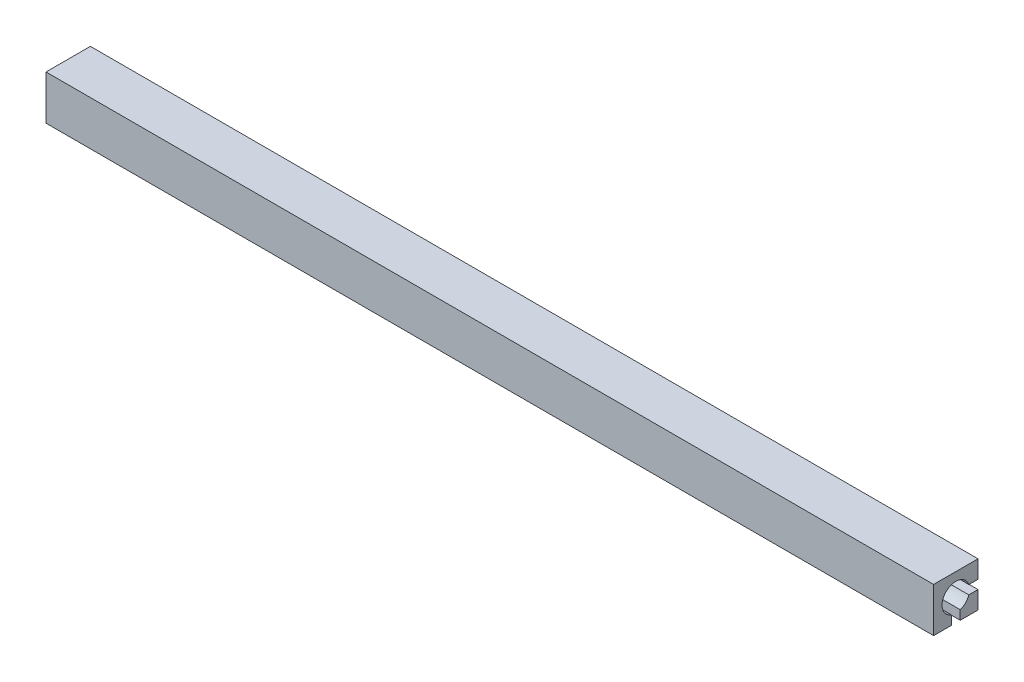
ISO-10303-21;
HEADER;
FILE_DESCRIPTION(('STEP AP214'),'2;1');
FILE_NAME('part.step','',(''),(''),'','','');
FILE_SCHEMA(('AUTOMOTIVE_DESIGN { 1 0 10303 214 1 1 1 1 }'));
ENDSEC;
DATA;
#1=APPLICATION_CONTEXT('core data for automotive mechanical design processes');
#2=APPLICATION_PROTOCOL_DEFINITION('international standard','automotive_design',2000,#1);
#3=PRODUCT_CONTEXT('',#1,'mechanical');
#4=PRODUCT('Part','Part','',(#3));
#5=PRODUCT_RELATED_PRODUCT_CATEGORY('part','',(#4));
#6=PRODUCT_DEFINITION_FORMATION('','',#4);
#7=PRODUCT_DEFINITION_CONTEXT('part definition',#1,'design');
#8=PRODUCT_DEFINITION('design','',#6,#7);
#9=PRODUCT_DEFINITION_SHAPE('','',#8);
#10=(LENGTH_UNIT() NAMED_UNIT(*) SI_UNIT(.MILLI.,.METRE.));
#11=(NAMED_UNIT(*) PLANE_ANGLE_UNIT() SI_UNIT($,.RADIAN.));
#12=(NAMED_UNIT(*) SI_UNIT($,.STERADIAN.) SOLID_ANGLE_UNIT());
#13=UNCERTAINTY_MEASURE_WITH_UNIT(LENGTH_MEASURE(1.E-05),#10,'distance_accuracy_value','');
#14=(GEOMETRIC_REPRESENTATION_CONTEXT(3) GLOBAL_UNCERTAINTY_ASSIGNED_CONTEXT((#13)) GLOBAL_UNIT_ASSIGNED_CONTEXT((#10,
#11,#12)) REPRESENTATION_CONTEXT('',''));
#15=CARTESIAN_POINT('',(0.,0.,0.));
#16=DIRECTION('',(0.,0.,1.));
#17=DIRECTION('',(1.,0.,0.));
#18=AXIS2_PLACEMENT_3D('',#15,#16,#17);
#19=CARTESIAN_POINT('',(0.,-6.50000000000001,0.));
#20=DIRECTION('',(0.,1.,0.));
#21=DIRECTION('',(0.,0.,1.));
#22=AXIS2_PLACEMENT_3D('',#19,#20,#21);
#23=PLANE('',#22);
#24=DIRECTION('',(0.,0.,-1.));
#25=VECTOR('',#24,1.);
#26=CARTESIAN_POINT('',(199.8,-6.50000000000001,0.));
#27=LINE('',#26,#25);
#28=CARTESIAN_POINT('',(199.8,-6.50000000000001,216.));
#29=VERTEX_POINT('',#28);
#30=CARTESIAN_POINT('',(199.8,-6.50000000000001,214.));
#31=VERTEX_POINT('',#30);
#32=EDGE_CURVE('E222',#29,#31,#27,.T.);
#33=ORIENTED_EDGE('',*,*,#32,.F.);
#34=DIRECTION('',(1.,0.,0.));
#35=VECTOR('',#34,1.);
#36=CARTESIAN_POINT('',(6.5,-6.50000000000001,216.));
#37=LINE('',#36,#35);
#38=CARTESIAN_POINT('',(20.2,-6.50000000000001,216.));
#39=VERTEX_POINT('',#38);
#40=EDGE_CURVE('E320',#39,#29,#37,.T.);
#41=ORIENTED_EDGE('',*,*,#40,.F.);
#42=DIRECTION('',(0.,0.,1.));
#43=VECTOR('',#42,1.);
#44=CARTESIAN_POINT('',(20.2,-6.50000000000001,0.));
#45=LINE('',#44,#43);
#46=CARTESIAN_POINT('',(20.2,-6.50000000000001,214.));
#47=VERTEX_POINT('',#46);
#48=EDGE_CURVE('E253',#47,#39,#45,.T.);
#49=ORIENTED_EDGE('',*,*,#48,.F.);
#50=DIRECTION('',(1.,0.,0.));
#51=VECTOR('',#50,1.);
#52=CARTESIAN_POINT('',(6.5,-6.50000000000001,214.));
#53=LINE('',#52,#51);
#54=EDGE_CURVE('E324',#47,#31,#53,.T.);
#55=ORIENTED_EDGE('',*,*,#54,.T.);
#56=EDGE_LOOP('',(#33,#41,#49,#55));
#57=FACE_BOUND('',#56,.T.);
#58=ADVANCED_FACE('F42',(#57),#23,.F.);
#59=CARTESIAN_POINT('',(0.,-220.000000000001,213.499999999999));
#60=DIRECTION('',(0.,0.,-1.));
#61=DIRECTION('',(0.,1.,0.));
#62=AXIS2_PLACEMENT_3D('',#59,#60,#61);
#63=PLANE('',#62);
#64=DIRECTION('',(1.,0.,0.));
#65=VECTOR('',#64,1.);
#66=CARTESIAN_POINT('',(6.5,-4.00000000000107,213.500000000001));
#67=LINE('',#66,#65);
#68=CARTESIAN_POINT('',(20.2,-4.00000000000106,213.500000000001));
#69=VERTEX_POINT('',#68);
#70=CARTESIAN_POINT('',(199.8,-4.,213.500000000001));
#71=VERTEX_POINT('',#70);
#72=EDGE_CURVE('E313',#69,#71,#67,.T.);
#73=ORIENTED_EDGE('',*,*,#72,.T.);
#74=DIRECTION('',(0.,-1.,0.));
#75=VECTOR('',#74,1.);
#76=CARTESIAN_POINT('',(199.8,-220.000000000001,213.499999999999));
#77=LINE('',#76,#75);
#78=CARTESIAN_POINT('',(199.8,-6.00000000000106,213.500000000001));
#79=VERTEX_POINT('',#78);
#80=EDGE_CURVE('E185',#71,#79,#77,.T.);
#81=ORIENTED_EDGE('',*,*,#80,.T.);
#82=DIRECTION('',(1.,0.,0.));
#83=VECTOR('',#82,1.);
#84=CARTESIAN_POINT('',(6.5,-6.00000000000107,213.500000000001));
#85=LINE('',#84,#83);
#86=CARTESIAN_POINT('',(20.2,-6.00000000000106,213.500000000001));
#87=VERTEX_POINT('',#86);
#88=EDGE_CURVE('E316',#87,#79,#85,.T.);
#89=ORIENTED_EDGE('',*,*,#88,.F.);
#90=DIRECTION('',(0.,1.,0.));
#91=VECTOR('',#90,1.);
#92=CARTESIAN_POINT('',(20.2,-220.000000000001,213.499999999999));
#93=LINE('',#92,#91);
#94=EDGE_CURVE('E372',#87,#69,#93,.T.);
#95=ORIENTED_EDGE('',*,*,#94,.T.);
#96=EDGE_LOOP('',(#73,#81,#89,#95));
#97=FACE_BOUND('',#96,.T.);
#98=ADVANCED_FACE('F427',(#97),#63,.T.);
#99=CARTESIAN_POINT('',(210.,-10.,210.));
#100=DIRECTION('',(-1.,0.,0.));
#101=DIRECTION('',(0.,0.,1.));
#102=AXIS2_PLACEMENT_3D('',#99,#100,#101);
#103=PLANE('',#102);
#104=DIRECTION('',(0.,0.,1.));
#105=VECTOR('',#104,1.);
#106=CARTESIAN_POINT('',(210.,-6.,6.5));
#107=LINE('',#106,#105);
#108=CARTESIAN_POINT('',(210.,-6.00000000000107,210.));
#109=VERTEX_POINT('',#108);
#110=CARTESIAN_POINT('',(210.,-6.,212.065719849776));
#111=VERTEX_POINT('',#110);
#112=EDGE_CURVE('E281',#109,#111,#107,.T.);
#113=ORIENTED_EDGE('',*,*,#112,.T.);
#114=CARTESIAN_POINT('',(210.,-5.,215.));
#115=DIRECTION('',(-1.,0.,0.));
#116=DIRECTION('',(0.,0.,1.));
#117=AXIS2_PLACEMENT_3D('',#114,#115,#116);
#118=CIRCLE('',#117,3.09999999999999);
#119=CARTESIAN_POINT('',(210.,-7.93428015022423,214.));
#120=VERTEX_POINT('',#119);
#121=EDGE_CURVE('E51',#111,#120,#118,.T.);
#122=ORIENTED_EDGE('',*,*,#121,.T.);
#123=DIRECTION('',(0.,1.,0.));
#124=VECTOR('',#123,1.);
#125=CARTESIAN_POINT('',(210.,-6.50000000000001,214.));
#126=LINE('',#125,#124);
#127=CARTESIAN_POINT('',(210.,-10.,214.));
#128=VERTEX_POINT('',#127);
#129=EDGE_CURVE('E285',#128,#120,#126,.T.);
#130=ORIENTED_EDGE('',*,*,#129,.F.);
#131=DIRECTION('',(0.,0.,-1.));
#132=VECTOR('',#131,1.);
#133=CARTESIAN_POINT('',(210.,-10.,220.));
#134=LINE('',#133,#132);
#135=CARTESIAN_POINT('',(210.,-10.,210.));
#136=VERTEX_POINT('',#135);
#137=EDGE_CURVE('E341',#128,#136,#134,.T.);
#138=ORIENTED_EDGE('',*,*,#137,.T.);
#139=DIRECTION('',(0.,-1.,0.));
#140=VECTOR('',#139,1.);
#141=CARTESIAN_POINT('',(210.,-10.,210.));
#142=LINE('',#141,#140);
#143=EDGE_CURVE('E268',#109,#136,#142,.T.);
#144=ORIENTED_EDGE('',*,*,#143,.F.);
#145=EDGE_LOOP('',(#113,#122,#130,#138,#144));
#146=FACE_BOUND('',#145,.T.);
#147=ADVANCED_FACE('F378',(#146),#103,.F.);
#148=CARTESIAN_POINT('',(10.,-10.,210.));
#149=DIRECTION('',(1.,0.,0.));
#150=DIRECTION('',(0.,0.,-1.));
#151=AXIS2_PLACEMENT_3D('',#148,#149,#150);
#152=PLANE('',#151);
#153=DIRECTION('',(0.,0.,-1.));
#154=VECTOR('',#153,1.);
#155=CARTESIAN_POINT('',(10.,-4.,6.5));
#156=LINE('',#155,#154);
#157=CARTESIAN_POINT('',(10.,-4.,212.065719849776));
#158=VERTEX_POINT('',#157);
#159=CARTESIAN_POINT('',(10.,-4.,210.));
#160=VERTEX_POINT('',#159);
#161=EDGE_CURVE('E297',#158,#160,#156,.T.);
#162=ORIENTED_EDGE('',*,*,#161,.F.);
#163=CARTESIAN_POINT('',(10.,-5.,215.));
#164=DIRECTION('',(1.,0.,0.));
#165=DIRECTION('',(0.,0.,-1.));
#166=AXIS2_PLACEMENT_3D('',#163,#164,#165);
#167=CIRCLE('',#166,3.09999999999999);
#168=CARTESIAN_POINT('',(10.,-7.93428015022423,216.));
#169=VERTEX_POINT('',#168);
#170=EDGE_CURVE('E371',#158,#169,#167,.T.);
#171=ORIENTED_EDGE('',*,*,#170,.T.);
#172=DIRECTION('',(0.,-1.,0.));
#173=VECTOR('',#172,1.);
#174=CARTESIAN_POINT('',(10.,-6.50000000000001,216.));
#175=LINE('',#174,#173);
#176=CARTESIAN_POINT('',(10.,-10.,216.));
#177=VERTEX_POINT('',#176);
#178=EDGE_CURVE('E306',#169,#177,#175,.T.);
#179=ORIENTED_EDGE('',*,*,#178,.T.);
#180=DIRECTION('',(0.,0.,-1.));
#181=VECTOR('',#180,1.);
#182=CARTESIAN_POINT('',(10.,-10.,220.));
#183=LINE('',#182,#181);
#184=CARTESIAN_POINT('',(10.,-10.,220.));
#185=VERTEX_POINT('',#184);
#186=EDGE_CURVE('E337',#185,#177,#183,.T.);
#187=ORIENTED_EDGE('',*,*,#186,.F.);
#188=DIRECTION('',(0.,1.,0.));
#189=VECTOR('',#188,1.);
#190=CARTESIAN_POINT('',(10.,-10.,220.));
#191=LINE('',#190,#189);
#192=CARTESIAN_POINT('',(10.,0.,220.));
#193=VERTEX_POINT('',#192);
#194=EDGE_CURVE('E263',#185,#193,#191,.T.);
#195=ORIENTED_EDGE('',*,*,#194,.T.);
#196=DIRECTION('',(0.,0.,1.));
#197=VECTOR('',#196,1.);
#198=CARTESIAN_POINT('',(10.,0.,10.));
#199=LINE('',#198,#197);
#200=CARTESIAN_POINT('',(10.,0.,210.));
#201=VERTEX_POINT('',#200);
#202=EDGE_CURVE('E309',#201,#193,#199,.T.);
#203=ORIENTED_EDGE('',*,*,#202,.F.);
#204=DIRECTION('',(0.,1.,0.));
#205=VECTOR('',#204,1.);
#206=CARTESIAN_POINT('',(10.,-10.,210.));
#207=LINE('',#206,#205);
#208=EDGE_CURVE('E269',#160,#201,#207,.T.);
#209=ORIENTED_EDGE('',*,*,#208,.F.);
#210=EDGE_LOOP('',(#162,#171,#179,#187,#195,#203,#209));
#211=FACE_BOUND('',#210,.T.);
#212=ADVANCED_FACE('F420',(#211),#152,.F.);
#213=CARTESIAN_POINT('',(0.,0.,210.));
#214=DIRECTION('',(0.,0.,1.));
#215=DIRECTION('',(1.,0.,0.));
#216=AXIS2_PLACEMENT_3D('',#213,#214,#215);
#217=PLANE('',#216);
#218=DIRECTION('',(-1.,0.,0.));
#219=VECTOR('',#218,1.);
#220=CARTESIAN_POINT('',(10.,-10.,210.));
#221=LINE('',#220,#219);
#222=CARTESIAN_POINT('',(10.,-10.,210.));
#223=VERTEX_POINT('',#222);
#224=EDGE_CURVE('E328',#136,#223,#221,.T.);
#225=ORIENTED_EDGE('',*,*,#224,.T.);
#226=CARTESIAN_POINT('',(10.,-6.00000000000107,210.));
#227=VERTEX_POINT('',#226);
#228=EDGE_CURVE('E264',#223,#227,#207,.T.);
#229=ORIENTED_EDGE('',*,*,#228,.T.);
#230=DIRECTION('',(1.,0.,0.));
#231=VECTOR('',#230,1.);
#232=CARTESIAN_POINT('',(0.,-6.00000000000103,210.));
#233=LINE('',#232,#231);
#234=EDGE_CURVE('E361',#227,#109,#233,.T.);
#235=ORIENTED_EDGE('',*,*,#234,.T.);
#236=ORIENTED_EDGE('',*,*,#143,.T.);
#237=EDGE_LOOP('',(#225,#229,#235,#236));
#238=FACE_BOUND('',#237,.T.);
#239=ADVANCED_FACE('F435',(#238),#217,.F.);
#240=CARTESIAN_POINT('',(6.5,-6.50000000000001,216.));
#241=DIRECTION('',(0.,0.,-1.));
#242=DIRECTION('',(-1.,0.,0.));
#243=AXIS2_PLACEMENT_3D('',#240,#241,#242);
#244=PLANE('',#243);
#245=DIRECTION('',(1.,0.,0.));
#246=VECTOR('',#245,1.);
#247=CARTESIAN_POINT('',(199.8,-7.93428015022423,216.));
#248=LINE('',#247,#246);
#249=CARTESIAN_POINT('',(210.,-7.93428015022423,216.));
#250=VERTEX_POINT('',#249);
#251=CARTESIAN_POINT('',(199.8,-7.93428015022423,216.));
#252=VERTEX_POINT('',#251);
#253=EDGE_CURVE('E191',#250,#252,#248,.F.);
#254=ORIENTED_EDGE('',*,*,#253,.F.);
#255=DIRECTION('',(0.,1.,0.));
#256=VECTOR('',#255,1.);
#257=CARTESIAN_POINT('',(210.,-6.50000000000001,216.));
#258=LINE('',#257,#256);
#259=CARTESIAN_POINT('',(210.,-10.,216.));
#260=VERTEX_POINT('',#259);
#261=EDGE_CURVE('E289',#260,#250,#258,.T.);
#262=ORIENTED_EDGE('',*,*,#261,.F.);
#263=DIRECTION('',(1.,0.,0.));
#264=VECTOR('',#263,1.);
#265=CARTESIAN_POINT('',(10.,-10.,216.));
#266=LINE('',#265,#264);
#267=EDGE_CURVE('E357',#177,#260,#266,.T.);
#268=ORIENTED_EDGE('',*,*,#267,.F.);
#269=ORIENTED_EDGE('',*,*,#178,.F.);
#270=DIRECTION('',(-1.,0.,0.));
#271=VECTOR('',#270,1.);
#272=CARTESIAN_POINT('',(20.2,-7.93428015022423,216.));
#273=LINE('',#272,#271);
#274=CARTESIAN_POINT('',(20.2,-7.93428015022423,216.));
#275=VERTEX_POINT('',#274);
#276=EDGE_CURVE('E243',#275,#169,#273,.T.);
#277=ORIENTED_EDGE('',*,*,#276,.F.);
#278=DIRECTION('',(0.,1.,0.));
#279=VECTOR('',#278,1.);
#280=CARTESIAN_POINT('',(20.2,-6.50000000000001,216.));
#281=LINE('',#280,#279);
#282=EDGE_CURVE('E259',#275,#39,#281,.T.);
#283=ORIENTED_EDGE('',*,*,#282,.T.);
#284=ORIENTED_EDGE('',*,*,#40,.T.);
#285=DIRECTION('',(0.,-1.,0.));
#286=VECTOR('',#285,1.);
#287=CARTESIAN_POINT('',(199.8,-6.50000000000001,216.));
#288=LINE('',#287,#286);
#289=EDGE_CURVE('E225',#29,#252,#288,.T.);
#290=ORIENTED_EDGE('',*,*,#289,.T.);
#291=EDGE_LOOP('',(#254,#262,#268,#269,#277,#283,#284,#290));
#292=FACE_BOUND('',#291,.T.);
#293=ADVANCED_FACE('F412',(#292),#244,.T.);
#294=CARTESIAN_POINT('',(6.5,-6.50000000000001,214.));
#295=DIRECTION('',(0.,0.,-1.));
#296=DIRECTION('',(-1.,0.,0.));
#297=AXIS2_PLACEMENT_3D('',#294,#295,#296);
#298=PLANE('',#297);
#299=ORIENTED_EDGE('',*,*,#129,.T.);
#300=DIRECTION('',(1.,0.,0.));
#301=VECTOR('',#300,1.);
#302=CARTESIAN_POINT('',(199.8,-7.93428015022423,214.));
#303=LINE('',#302,#301);
#304=CARTESIAN_POINT('',(199.8,-7.93428015022423,214.));
#305=VERTEX_POINT('',#304);
#306=EDGE_CURVE('E203',#120,#305,#303,.F.);
#307=ORIENTED_EDGE('',*,*,#306,.T.);
#308=DIRECTION('',(0.,-1.,0.));
#309=VECTOR('',#308,1.);
#310=CARTESIAN_POINT('',(199.8,-6.50000000000001,214.));
#311=LINE('',#310,#309);
#312=EDGE_CURVE('E219',#31,#305,#311,.T.);
#313=ORIENTED_EDGE('',*,*,#312,.F.);
#314=ORIENTED_EDGE('',*,*,#54,.F.);
#315=DIRECTION('',(0.,1.,0.));
#316=VECTOR('',#315,1.);
#317=CARTESIAN_POINT('',(20.2,-6.50000000000001,214.));
#318=LINE('',#317,#316);
#319=CARTESIAN_POINT('',(20.2,-7.93428015022423,214.));
#320=VERTEX_POINT('',#319);
#321=EDGE_CURVE('E256',#320,#47,#318,.T.);
#322=ORIENTED_EDGE('',*,*,#321,.F.);
#323=DIRECTION('',(-1.,0.,0.));
#324=VECTOR('',#323,1.);
#325=CARTESIAN_POINT('',(20.2,-7.93428015022423,214.));
#326=LINE('',#325,#324);
#327=CARTESIAN_POINT('',(10.,-7.93428015022423,214.));
#328=VERTEX_POINT('',#327);
#329=EDGE_CURVE('E239',#320,#328,#326,.T.);
#330=ORIENTED_EDGE('',*,*,#329,.T.);
#331=DIRECTION('',(0.,-1.,0.));
#332=VECTOR('',#331,1.);
#333=CARTESIAN_POINT('',(10.,-6.50000000000001,214.));
#334=LINE('',#333,#332);
#335=CARTESIAN_POINT('',(10.,-10.,214.));
#336=VERTEX_POINT('',#335);
#337=EDGE_CURVE('E303',#328,#336,#334,.T.);
#338=ORIENTED_EDGE('',*,*,#337,.T.);
#339=DIRECTION('',(1.,0.,0.));
#340=VECTOR('',#339,1.);
#341=CARTESIAN_POINT('',(10.,-10.,214.));
#342=LINE('',#341,#340);
#343=EDGE_CURVE('E350',#336,#128,#342,.T.);
#344=ORIENTED_EDGE('',*,*,#343,.T.);
#345=EDGE_LOOP('',(#299,#307,#313,#314,#322,#330,#338,#344));
#346=FACE_BOUND('',#345,.T.);
#347=ADVANCED_FACE('F383',(#346),#298,.F.);
#348=CARTESIAN_POINT('',(10.,-10.,220.));
#349=DIRECTION('',(0.,-1.,0.));
#350=DIRECTION('',(0.,0.,-1.));
#351=AXIS2_PLACEMENT_3D('',#348,#349,#350);
#352=PLANE('',#351);
#353=ORIENTED_EDGE('',*,*,#186,.T.);
#354=ORIENTED_EDGE('',*,*,#267,.T.);
#355=CARTESIAN_POINT('',(210.,-10.,220.));
#356=VERTEX_POINT('',#355);
#357=EDGE_CURVE('E342',#356,#260,#134,.T.);
#358=ORIENTED_EDGE('',*,*,#357,.F.);
#359=DIRECTION('',(-1.,0.,0.));
#360=VECTOR('',#359,1.);
#361=CARTESIAN_POINT('',(10.,-10.,220.));
#362=LINE('',#361,#360);
#363=EDGE_CURVE('E329',#356,#185,#362,.T.);
#364=ORIENTED_EDGE('',*,*,#363,.T.);
#365=EDGE_LOOP('',(#353,#354,#358,#364));
#366=FACE_BOUND('',#365,.T.);
#367=ADVANCED_FACE('F448',(#366),#352,.T.);
#368=CARTESIAN_POINT('',(0.,0.,10.));
#369=DIRECTION('',(0.,-1.,0.));
#370=DIRECTION('',(0.,0.,-1.));
#371=AXIS2_PLACEMENT_3D('',#368,#369,#370);
#372=PLANE('',#371);
#373=DIRECTION('',(-1.,0.,0.));
#374=VECTOR('',#373,1.);
#375=CARTESIAN_POINT('',(0.,0.,210.));
#376=LINE('',#375,#374);
#377=CARTESIAN_POINT('',(210.,0.,210.));
#378=VERTEX_POINT('',#377);
#379=EDGE_CURVE('E345',#378,#201,#376,.T.);
#380=ORIENTED_EDGE('',*,*,#379,.T.);
#381=ORIENTED_EDGE('',*,*,#202,.T.);
#382=DIRECTION('',(-1.,0.,0.));
#383=VECTOR('',#382,1.);
#384=CARTESIAN_POINT('',(0.,0.,220.));
#385=LINE('',#384,#383);
#386=CARTESIAN_POINT('',(210.,0.,220.));
#387=VERTEX_POINT('',#386);
#388=EDGE_CURVE('E346',#387,#193,#385,.T.);
#389=ORIENTED_EDGE('',*,*,#388,.F.);
#390=DIRECTION('',(0.,0.,-1.));
#391=VECTOR('',#390,1.);
#392=CARTESIAN_POINT('',(210.,0.,10.));
#393=LINE('',#392,#391);
#394=EDGE_CURVE('E293',#387,#378,#393,.T.);
#395=ORIENTED_EDGE('',*,*,#394,.T.);
#396=EDGE_LOOP('',(#380,#381,#389,#395));
#397=FACE_BOUND('',#396,.T.);
#398=ADVANCED_FACE('F44',(#397),#372,.F.);
#399=CARTESIAN_POINT('',(0.,-6.,6.5));
#400=DIRECTION('',(0.,1.,0.));
#401=DIRECTION('',(0.,0.,1.));
#402=AXIS2_PLACEMENT_3D('',#399,#400,#401);
#403=PLANE('',#402);
#404=DIRECTION('',(1.,0.,0.));
#405=VECTOR('',#404,1.);
#406=CARTESIAN_POINT('',(199.8,-6.,212.065719849776));
#407=LINE('',#406,#405);
#408=CARTESIAN_POINT('',(199.8,-6.,212.065719849776));
#409=VERTEX_POINT('',#408);
#410=EDGE_CURVE('E200',#111,#409,#407,.F.);
#411=ORIENTED_EDGE('',*,*,#410,.F.);
#412=ORIENTED_EDGE('',*,*,#112,.F.);
#413=ORIENTED_EDGE('',*,*,#234,.F.);
#414=DIRECTION('',(0.,0.,-1.));
#415=VECTOR('',#414,1.);
#416=CARTESIAN_POINT('',(10.,-6.,6.5));
#417=LINE('',#416,#415);
#418=CARTESIAN_POINT('',(10.,-6.,212.065719849776));
#419=VERTEX_POINT('',#418);
#420=EDGE_CURVE('E300',#419,#227,#417,.T.);
#421=ORIENTED_EDGE('',*,*,#420,.F.);
#422=DIRECTION('',(-1.,0.,0.));
#423=VECTOR('',#422,1.);
#424=CARTESIAN_POINT('',(20.2,-6.,212.065719849776));
#425=LINE('',#424,#423);
#426=CARTESIAN_POINT('',(20.2,-6.,212.065719849776));
#427=VERTEX_POINT('',#426);
#428=EDGE_CURVE('E66',#427,#419,#425,.T.);
#429=ORIENTED_EDGE('',*,*,#428,.F.);
#430=DIRECTION('',(0.,0.,1.));
#431=VECTOR('',#430,1.);
#432=CARTESIAN_POINT('',(20.2,-6.,6.5));
#433=LINE('',#432,#431);
#434=EDGE_CURVE('E249',#427,#87,#433,.T.);
#435=ORIENTED_EDGE('',*,*,#434,.T.);
#436=ORIENTED_EDGE('',*,*,#88,.T.);
#437=DIRECTION('',(0.,0.,-1.));
#438=VECTOR('',#437,1.);
#439=CARTESIAN_POINT('',(199.8,-6.,6.5));
#440=LINE('',#439,#438);
#441=EDGE_CURVE('E215',#79,#409,#440,.T.);
#442=ORIENTED_EDGE('',*,*,#441,.T.);
#443=EDGE_LOOP('',(#411,#412,#413,#421,#429,#435,#436,#442));
#444=FACE_BOUND('',#443,.T.);
#445=ADVANCED_FACE('F429',(#444),#403,.T.);
#446=CARTESIAN_POINT('',(0.,-4.,6.5));
#447=DIRECTION('',(0.,1.,0.));
#448=DIRECTION('',(0.,0.,1.));
#449=AXIS2_PLACEMENT_3D('',#446,#447,#448);
#450=PLANE('',#449);
#451=DIRECTION('',(0.,0.,1.));
#452=VECTOR('',#451,1.);
#453=CARTESIAN_POINT('',(210.,-4.,6.5));
#454=LINE('',#453,#452);
#455=CARTESIAN_POINT('',(210.,-4.,210.));
#456=VERTEX_POINT('',#455);
#457=CARTESIAN_POINT('',(210.,-4.,212.065719849776));
#458=VERTEX_POINT('',#457);
#459=EDGE_CURVE('E198',#456,#458,#454,.T.);
#460=ORIENTED_EDGE('',*,*,#459,.T.);
#461=DIRECTION('',(1.,0.,0.));
#462=VECTOR('',#461,1.);
#463=CARTESIAN_POINT('',(199.8,-4.,212.065719849776));
#464=LINE('',#463,#462);
#465=CARTESIAN_POINT('',(199.8,-4.,212.065719849776));
#466=VERTEX_POINT('',#465);
#467=EDGE_CURVE('E58',#458,#466,#464,.F.);
#468=ORIENTED_EDGE('',*,*,#467,.T.);
#469=DIRECTION('',(0.,0.,-1.));
#470=VECTOR('',#469,1.);
#471=CARTESIAN_POINT('',(199.8,-4.,6.5));
#472=LINE('',#471,#470);
#473=EDGE_CURVE('E11',#71,#466,#472,.T.);
#474=ORIENTED_EDGE('',*,*,#473,.F.);
#475=ORIENTED_EDGE('',*,*,#72,.F.);
#476=DIRECTION('',(0.,0.,1.));
#477=VECTOR('',#476,1.);
#478=CARTESIAN_POINT('',(20.2,-4.,6.5));
#479=LINE('',#478,#477);
#480=CARTESIAN_POINT('',(20.2,-4.,212.065719849776));
#481=VERTEX_POINT('',#480);
#482=EDGE_CURVE('E246',#481,#69,#479,.T.);
#483=ORIENTED_EDGE('',*,*,#482,.F.);
#484=DIRECTION('',(-1.,0.,0.));
#485=VECTOR('',#484,1.);
#486=CARTESIAN_POINT('',(20.2,-4.,212.065719849776));
#487=LINE('',#486,#485);
#488=EDGE_CURVE('E233',#481,#158,#487,.T.);
#489=ORIENTED_EDGE('',*,*,#488,.T.);
#490=ORIENTED_EDGE('',*,*,#161,.T.);
#491=DIRECTION('',(1.,0.,0.));
#492=VECTOR('',#491,1.);
#493=CARTESIAN_POINT('',(0.,-4.00000000000103,210.));
#494=LINE('',#493,#492);
#495=EDGE_CURVE('E365',#160,#456,#494,.T.);
#496=ORIENTED_EDGE('',*,*,#495,.T.);
#497=EDGE_LOOP('',(#460,#468,#474,#475,#483,#489,#490,#496));
#498=FACE_BOUND('',#497,.T.);
#499=ADVANCED_FACE('F196',(#498),#450,.F.);
#500=ORIENTED_EDGE('',*,*,#495,.F.);
#501=ORIENTED_EDGE('',*,*,#208,.T.);
#502=ORIENTED_EDGE('',*,*,#379,.F.);
#503=EDGE_CURVE('E273',#378,#456,#142,.T.);
#504=ORIENTED_EDGE('',*,*,#503,.T.);
#505=EDGE_LOOP('',(#500,#501,#502,#504));
#506=FACE_BOUND('',#505,.T.);
#507=ADVANCED_FACE('F456',(#506),#217,.F.);
#508=CARTESIAN_POINT('',(0.,0.,220.));
#509=DIRECTION('',(0.,0.,1.));
#510=DIRECTION('',(1.,0.,0.));
#511=AXIS2_PLACEMENT_3D('',#508,#509,#510);
#512=PLANE('',#511);
#513=ORIENTED_EDGE('',*,*,#194,.F.);
#514=ORIENTED_EDGE('',*,*,#363,.F.);
#515=DIRECTION('',(0.,-1.,0.));
#516=VECTOR('',#515,1.);
#517=CARTESIAN_POINT('',(210.,-10.,220.));
#518=LINE('',#517,#516);
#519=EDGE_CURVE('E276',#387,#356,#518,.T.);
#520=ORIENTED_EDGE('',*,*,#519,.F.);
#521=ORIENTED_EDGE('',*,*,#388,.T.);
#522=EDGE_LOOP('',(#513,#514,#520,#521));
#523=FACE_BOUND('',#522,.T.);
#524=ADVANCED_FACE('F451',(#523),#512,.T.);
#525=ORIENTED_EDGE('',*,*,#343,.F.);
#526=EDGE_CURVE('E333',#336,#223,#183,.T.);
#527=ORIENTED_EDGE('',*,*,#526,.T.);
#528=ORIENTED_EDGE('',*,*,#224,.F.);
#529=ORIENTED_EDGE('',*,*,#137,.F.);
#530=EDGE_LOOP('',(#525,#527,#528,#529));
#531=FACE_BOUND('',#530,.T.);
#532=ADVANCED_FACE('F392',(#531),#352,.T.);
#533=ORIENTED_EDGE('',*,*,#261,.T.);
#534=CARTESIAN_POINT('',(210.,-5.,215.));
#535=DIRECTION('',(1.,0.,0.));
#536=DIRECTION('',(0.,0.,-1.));
#537=AXIS2_PLACEMENT_3D('',#534,#535,#536);
#538=CIRCLE('',#537,3.09999999999999);
#539=EDGE_CURVE('E206',#458,#250,#538,.T.);
#540=ORIENTED_EDGE('',*,*,#539,.F.);
#541=ORIENTED_EDGE('',*,*,#459,.F.);
#542=ORIENTED_EDGE('',*,*,#503,.F.);
#543=ORIENTED_EDGE('',*,*,#394,.F.);
#544=ORIENTED_EDGE('',*,*,#519,.T.);
#545=ORIENTED_EDGE('',*,*,#357,.T.);
#546=EDGE_LOOP('',(#533,#540,#541,#542,#543,#544,#545));
#547=FACE_BOUND('',#546,.T.);
#548=ADVANCED_FACE('F443',(#547),#103,.F.);
#549=ORIENTED_EDGE('',*,*,#337,.F.);
#550=EDGE_CURVE('E368',#328,#419,#167,.T.);
#551=ORIENTED_EDGE('',*,*,#550,.T.);
#552=ORIENTED_EDGE('',*,*,#420,.T.);
#553=ORIENTED_EDGE('',*,*,#228,.F.);
#554=ORIENTED_EDGE('',*,*,#526,.F.);
#555=EDGE_LOOP('',(#549,#551,#552,#553,#554));
#556=FACE_BOUND('',#555,.T.);
#557=ADVANCED_FACE('F433',(#556),#152,.F.);
#558=CARTESIAN_POINT('',(20.2,-5.,215.));
#559=DIRECTION('',(-1.,0.,0.));
#560=DIRECTION('',(0.,0.,1.));
#561=AXIS2_PLACEMENT_3D('',#558,#559,#560);
#562=CYLINDRICAL_SURFACE('',#561,3.09999999999999);
#563=CARTESIAN_POINT('',(20.2,-5.,215.));
#564=DIRECTION('',(-1.,0.,0.));
#565=DIRECTION('',(0.,0.,1.));
#566=AXIS2_PLACEMENT_3D('',#563,#564,#565);
#567=CIRCLE('',#566,3.09999999999999);
#568=EDGE_CURVE('E232',#427,#320,#567,.T.);
#569=ORIENTED_EDGE('',*,*,#568,.F.);
#570=ORIENTED_EDGE('',*,*,#428,.T.);
#571=ORIENTED_EDGE('',*,*,#550,.F.);
#572=ORIENTED_EDGE('',*,*,#329,.F.);
#573=EDGE_LOOP('',(#569,#570,#571,#572));
#574=FACE_BOUND('',#573,.T.);
#575=ADVANCED_FACE('F540',(#574),#562,.F.);
#576=ORIENTED_EDGE('',*,*,#276,.T.);
#577=ORIENTED_EDGE('',*,*,#170,.F.);
#578=ORIENTED_EDGE('',*,*,#488,.F.);
#579=EDGE_CURVE('E228',#275,#481,#567,.T.);
#580=ORIENTED_EDGE('',*,*,#579,.F.);
#581=EDGE_LOOP('',(#576,#577,#578,#580));
#582=FACE_BOUND('',#581,.T.);
#583=ADVANCED_FACE('F417',(#582),#562,.F.);
#584=CARTESIAN_POINT('',(20.2,-5.,215.));
#585=DIRECTION('',(-1.,0.,0.));
#586=DIRECTION('',(0.,0.,1.));
#587=AXIS2_PLACEMENT_3D('',#584,#585,#586);
#588=PLANE('',#587);
#589=ORIENTED_EDGE('',*,*,#579,.T.);
#590=ORIENTED_EDGE('',*,*,#482,.T.);
#591=ORIENTED_EDGE('',*,*,#94,.F.);
#592=ORIENTED_EDGE('',*,*,#434,.F.);
#593=ORIENTED_EDGE('',*,*,#568,.T.);
#594=ORIENTED_EDGE('',*,*,#321,.T.);
#595=ORIENTED_EDGE('',*,*,#48,.T.);
#596=ORIENTED_EDGE('',*,*,#282,.F.);
#597=EDGE_LOOP('',(#589,#590,#591,#592,#593,#594,#595,#596));
#598=FACE_BOUND('',#597,.T.);
#599=ADVANCED_FACE('F403',(#598),#588,.T.);
#600=CARTESIAN_POINT('',(199.8,-5.,215.));
#601=DIRECTION('',(1.,0.,0.));
#602=DIRECTION('',(0.,0.,-1.));
#603=AXIS2_PLACEMENT_3D('',#600,#601,#602);
#604=CYLINDRICAL_SURFACE('',#603,3.09999999999999);
#605=ORIENTED_EDGE('',*,*,#121,.F.);
#606=ORIENTED_EDGE('',*,*,#410,.T.);
#607=CARTESIAN_POINT('',(199.8,-5.,215.));
#608=DIRECTION('',(1.,0.,0.));
#609=DIRECTION('',(0.,0.,-1.));
#610=AXIS2_PLACEMENT_3D('',#607,#608,#609);
#611=CIRCLE('',#610,3.09999999999999);
#612=EDGE_CURVE('E193',#305,#409,#611,.T.);
#613=ORIENTED_EDGE('',*,*,#612,.F.);
#614=ORIENTED_EDGE('',*,*,#306,.F.);
#615=EDGE_LOOP('',(#605,#606,#613,#614));
#616=FACE_BOUND('',#615,.T.);
#617=ADVANCED_FACE('F438',(#616),#604,.F.);
#618=ORIENTED_EDGE('',*,*,#253,.T.);
#619=EDGE_CURVE('E182',#466,#252,#611,.T.);
#620=ORIENTED_EDGE('',*,*,#619,.F.);
#621=ORIENTED_EDGE('',*,*,#467,.F.);
#622=ORIENTED_EDGE('',*,*,#539,.T.);
#623=EDGE_LOOP('',(#618,#620,#621,#622));
#624=FACE_BOUND('',#623,.T.);
#625=ADVANCED_FACE('F189',(#624),#604,.F.);
#626=CARTESIAN_POINT('',(199.8,-5.,215.));
#627=DIRECTION('',(1.,0.,0.));
#628=DIRECTION('',(0.,0.,-1.));
#629=AXIS2_PLACEMENT_3D('',#626,#627,#628);
#630=PLANE('',#629);
#631=ORIENTED_EDGE('',*,*,#32,.T.);
#632=ORIENTED_EDGE('',*,*,#312,.T.);
#633=ORIENTED_EDGE('',*,*,#612,.T.);
#634=ORIENTED_EDGE('',*,*,#441,.F.);
#635=ORIENTED_EDGE('',*,*,#80,.F.);
#636=ORIENTED_EDGE('',*,*,#473,.T.);
#637=ORIENTED_EDGE('',*,*,#619,.T.);
#638=ORIENTED_EDGE('',*,*,#289,.F.);
#639=EDGE_LOOP('',(#631,#632,#633,#634,#635,#636,#637,#638));
#640=FACE_BOUND('',#639,.T.);
#641=ADVANCED_FACE('F181',(#640),#630,.T.);
#642=CLOSED_SHELL('',(#58,#98,#147,#212,#239,#293,#347,#367,#398,#445,#499,#507,#524,#532,#548,
#557,#575,#583,#599,#617,#625,#641));
#643=MANIFOLD_SOLID_BREP('B2',#642);
#644=ADVANCED_BREP_SHAPE_REPRESENTATION('',(#18,#643),#14);
#645=SHAPE_DEFINITION_REPRESENTATION(#9,#644);
ENDSEC;
END-ISO-10303-21;
